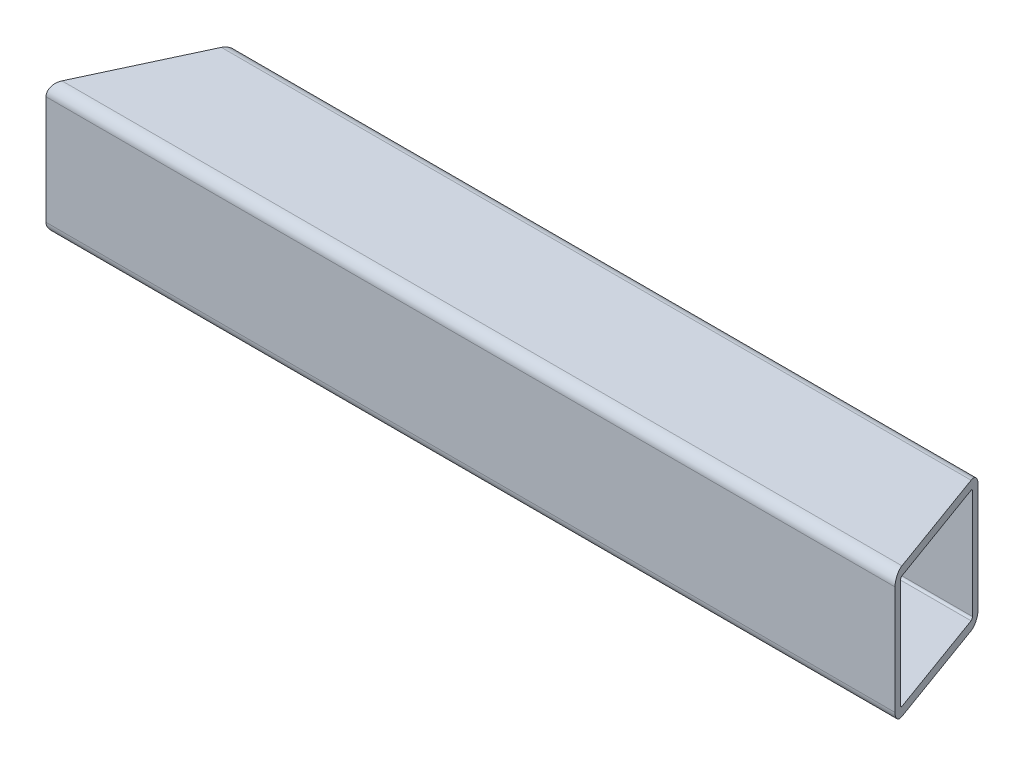
ISO-10303-21;
HEADER;
FILE_DESCRIPTION(('STEP AP214'),'2;1');
FILE_NAME('part.step','',(''),(''),'','','');
FILE_SCHEMA(('AUTOMOTIVE_DESIGN { 1 0 10303 214 1 1 1 1 }'));
ENDSEC;
DATA;
#1=APPLICATION_CONTEXT('core data for automotive mechanical design processes');
#2=APPLICATION_PROTOCOL_DEFINITION('international standard','automotive_design',2000,#1);
#3=PRODUCT_CONTEXT('',#1,'mechanical');
#4=PRODUCT('Part','Part','',(#3));
#5=PRODUCT_RELATED_PRODUCT_CATEGORY('part','',(#4));
#6=PRODUCT_DEFINITION_FORMATION('','',#4);
#7=PRODUCT_DEFINITION_CONTEXT('part definition',#1,'design');
#8=PRODUCT_DEFINITION('design','',#6,#7);
#9=PRODUCT_DEFINITION_SHAPE('','',#8);
#10=(LENGTH_UNIT() NAMED_UNIT(*) SI_UNIT(.MILLI.,.METRE.));
#11=(NAMED_UNIT(*) PLANE_ANGLE_UNIT() SI_UNIT($,.RADIAN.));
#12=(NAMED_UNIT(*) SI_UNIT($,.STERADIAN.) SOLID_ANGLE_UNIT());
#13=UNCERTAINTY_MEASURE_WITH_UNIT(LENGTH_MEASURE(1.E-05),#10,'distance_accuracy_value','');
#14=(GEOMETRIC_REPRESENTATION_CONTEXT(3) GLOBAL_UNCERTAINTY_ASSIGNED_CONTEXT((#13)) GLOBAL_UNIT_ASSIGNED_CONTEXT((#10,
#11,#12)) REPRESENTATION_CONTEXT('',''));
#15=CARTESIAN_POINT('',(0.,0.,0.));
#16=DIRECTION('',(0.,0.,1.));
#17=DIRECTION('',(1.,0.,0.));
#18=AXIS2_PLACEMENT_3D('',#15,#16,#17);
#19=CARTESIAN_POINT('',(123.98756,-15.875,15.875));
#20=DIRECTION('',(-1.,0.,0.));
#21=DIRECTION('',(0.,0.,1.));
#22=AXIS2_PLACEMENT_3D('',#19,#20,#21);
#23=CYLINDRICAL_SURFACE('',#22,3.175);
#24=CARTESIAN_POINT('',(-122.507033185358,-15.875,15.875));
#25=DIRECTION('',(-0.906307787036653,0.,-0.422618261740694));
#26=DIRECTION('',(-0.422618261740694,0.,0.906307787036653));
#27=AXIS2_PLACEMENT_3D('',#24,#25,#26);
#28=ELLIPSE('',#27,3.5032248927059,3.175);
#29=CARTESIAN_POINT('',(-122.507033185358,-19.05,15.875));
#30=VERTEX_POINT('',#29);
#31=CARTESIAN_POINT('',(-123.98756,-15.875,19.05));
#32=VERTEX_POINT('',#31);
#33=EDGE_CURVE('E199',#30,#32,#28,.T.);
#34=ORIENTED_EDGE('',*,*,#33,.F.);
#35=DIRECTION('',(-1.,0.,0.));
#36=VECTOR('',#35,1.);
#37=CARTESIAN_POINT('',(123.98756,-19.05,15.875));
#38=LINE('',#37,#36);
#39=CARTESIAN_POINT('',(122.831954506205,-19.05,15.875));
#40=VERTEX_POINT('',#39);
#41=EDGE_CURVE('E236',#40,#30,#38,.T.);
#42=ORIENTED_EDGE('',*,*,#41,.F.);
#43=CARTESIAN_POINT('',(122.831954506205,-15.875,15.875));
#44=DIRECTION('',(-0.939692620785911,0.,0.342020143325663));
#45=DIRECTION('',(-0.342020143325663,0.,-0.93969262078591));
#46=AXIS2_PLACEMENT_3D('',#43,#44,#45);
#47=ELLIPSE('',#46,3.37876442761102,3.175);
#48=CARTESIAN_POINT('',(123.98756,-15.875,19.05));
#49=VERTEX_POINT('',#48);
#50=EDGE_CURVE('E260',#40,#49,#47,.T.);
#51=ORIENTED_EDGE('',*,*,#50,.T.);
#52=DIRECTION('',(-1.,0.,0.));
#53=VECTOR('',#52,1.);
#54=CARTESIAN_POINT('',(123.98756,-15.875,19.05));
#55=LINE('',#54,#53);
#56=EDGE_CURVE('E219',#49,#32,#55,.T.);
#57=ORIENTED_EDGE('',*,*,#56,.T.);
#58=EDGE_LOOP('',(#34,#42,#51,#57));
#59=FACE_BOUND('',#58,.T.);
#60=ADVANCED_FACE('F81',(#59),#23,.T.);
#61=CARTESIAN_POINT('',(123.98756,-19.05,15.875));
#62=DIRECTION('',(0.,1.,0.));
#63=DIRECTION('',(0.,0.,1.));
#64=AXIS2_PLACEMENT_3D('',#61,#62,#63);
#65=PLANE('',#64);
#66=DIRECTION('',(-0.422618261740694,0.,0.906307787036653));
#67=VECTOR('',#66,1.);
#68=CARTESIAN_POINT('',(-78.4815717698162,-19.05,-78.5379066842573));
#69=LINE('',#68,#67);
#70=CARTESIAN_POINT('',(-107.701765038937,-19.05,-15.875));
#71=VERTEX_POINT('',#70);
#72=EDGE_CURVE('E305',#71,#30,#69,.T.);
#73=ORIENTED_EDGE('',*,*,#72,.F.);
#74=DIRECTION('',(-1.,0.,0.));
#75=VECTOR('',#74,1.);
#76=CARTESIAN_POINT('',(123.98756,-19.05,-15.875));
#77=LINE('',#76,#75);
#78=CARTESIAN_POINT('',(111.275899568253,-19.05,-15.875));
#79=VERTEX_POINT('',#78);
#80=EDGE_CURVE('E233',#79,#71,#77,.T.);
#81=ORIENTED_EDGE('',*,*,#80,.F.);
#82=DIRECTION('',(0.342020143325663,0.,0.93969262078591));
#83=VECTOR('',#82,1.);
#84=CARTESIAN_POINT('',(122.967134669623,-19.05,16.2464044465486));
#85=LINE('',#84,#83);
#86=EDGE_CURVE('E102',#79,#40,#85,.T.);
#87=ORIENTED_EDGE('',*,*,#86,.T.);
#88=ORIENTED_EDGE('',*,*,#41,.T.);
#89=EDGE_LOOP('',(#73,#81,#87,#88));
#90=FACE_BOUND('',#89,.T.);
#91=ADVANCED_FACE('F304',(#90),#65,.F.);
#92=CARTESIAN_POINT('',(123.98756,-15.875,-15.875));
#93=DIRECTION('',(-1.,0.,0.));
#94=DIRECTION('',(0.,0.,1.));
#95=AXIS2_PLACEMENT_3D('',#92,#93,#94);
#96=CYLINDRICAL_SURFACE('',#95,3.175);
#97=CARTESIAN_POINT('',(-107.701765038937,-15.875,-15.875));
#98=DIRECTION('',(-0.906307787036653,0.,-0.422618261740694));
#99=DIRECTION('',(-0.422618261740694,0.,0.906307787036653));
#100=AXIS2_PLACEMENT_3D('',#97,#98,#99);
#101=ELLIPSE('',#100,3.5032248927059,3.175);
#102=CARTESIAN_POINT('',(-106.221238224295,-15.875,-19.05));
#103=VERTEX_POINT('',#102);
#104=EDGE_CURVE('E306',#103,#71,#101,.T.);
#105=ORIENTED_EDGE('',*,*,#104,.F.);
#106=DIRECTION('',(-1.,0.,0.));
#107=VECTOR('',#106,1.);
#108=CARTESIAN_POINT('',(123.98756,-15.875,-19.05));
#109=LINE('',#108,#107);
#110=CARTESIAN_POINT('',(110.120294074458,-15.875,-19.05));
#111=VERTEX_POINT('',#110);
#112=EDGE_CURVE('E230',#111,#103,#109,.T.);
#113=ORIENTED_EDGE('',*,*,#112,.F.);
#114=CARTESIAN_POINT('',(111.275899568253,-15.875,-15.875));
#115=DIRECTION('',(-0.939692620785911,0.,0.342020143325663));
#116=DIRECTION('',(-0.342020143325663,0.,-0.93969262078591));
#117=AXIS2_PLACEMENT_3D('',#114,#115,#116);
#118=ELLIPSE('',#117,3.37876442761101,3.175);
#119=EDGE_CURVE('E296',#111,#79,#118,.T.);
#120=ORIENTED_EDGE('',*,*,#119,.T.);
#121=ORIENTED_EDGE('',*,*,#80,.T.);
#122=EDGE_LOOP('',(#105,#113,#120,#121));
#123=FACE_BOUND('',#122,.T.);
#124=ADVANCED_FACE('F301',(#123),#96,.T.);
#125=CARTESIAN_POINT('',(123.98756,15.875,-19.05));
#126=DIRECTION('',(0.,0.,1.));
#127=DIRECTION('',(0.,-1.,0.));
#128=AXIS2_PLACEMENT_3D('',#125,#126,#127);
#129=PLANE('',#128);
#130=DIRECTION('',(0.,-1.,0.));
#131=VECTOR('',#130,1.);
#132=CARTESIAN_POINT('',(-106.221238224295,379.908078836484,-19.05));
#133=LINE('',#132,#131);
#134=CARTESIAN_POINT('',(-106.221238224295,15.875,-19.05));
#135=VERTEX_POINT('',#134);
#136=EDGE_CURVE('E347',#135,#103,#133,.T.);
#137=ORIENTED_EDGE('',*,*,#136,.F.);
#138=DIRECTION('',(-1.,0.,0.));
#139=VECTOR('',#138,1.);
#140=CARTESIAN_POINT('',(123.98756,15.875,-19.05));
#141=LINE('',#140,#139);
#142=CARTESIAN_POINT('',(110.120294074458,15.875,-19.05));
#143=VERTEX_POINT('',#142);
#144=EDGE_CURVE('E227',#143,#135,#141,.T.);
#145=ORIENTED_EDGE('',*,*,#144,.F.);
#146=DIRECTION('',(0.,-1.,0.));
#147=VECTOR('',#146,1.);
#148=CARTESIAN_POINT('',(110.120294074458,383.876828836484,-19.05));
#149=LINE('',#148,#147);
#150=EDGE_CURVE('E308',#143,#111,#149,.T.);
#151=ORIENTED_EDGE('',*,*,#150,.T.);
#152=ORIENTED_EDGE('',*,*,#112,.T.);
#153=EDGE_LOOP('',(#137,#145,#151,#152));
#154=FACE_BOUND('',#153,.T.);
#155=ADVANCED_FACE('F352',(#154),#129,.F.);
#156=CARTESIAN_POINT('',(123.98756,15.875,-15.875));
#157=DIRECTION('',(-1.,0.,0.));
#158=DIRECTION('',(0.,0.,1.));
#159=AXIS2_PLACEMENT_3D('',#156,#157,#158);
#160=CYLINDRICAL_SURFACE('',#159,3.175);
#161=CARTESIAN_POINT('',(-107.701765038937,15.875,-15.875));
#162=DIRECTION('',(-0.906307787036653,0.,-0.422618261740694));
#163=DIRECTION('',(-0.422618261740694,0.,0.906307787036653));
#164=AXIS2_PLACEMENT_3D('',#161,#162,#163);
#165=ELLIPSE('',#164,3.50322489270591,3.175);
#166=CARTESIAN_POINT('',(-107.701765038937,19.05,-15.875));
#167=VERTEX_POINT('',#166);
#168=EDGE_CURVE('E310',#167,#135,#165,.T.);
#169=ORIENTED_EDGE('',*,*,#168,.F.);
#170=DIRECTION('',(-1.,0.,0.));
#171=VECTOR('',#170,1.);
#172=CARTESIAN_POINT('',(123.98756,19.05,-15.875));
#173=LINE('',#172,#171);
#174=CARTESIAN_POINT('',(111.275899568253,19.05,-15.875));
#175=VERTEX_POINT('',#174);
#176=EDGE_CURVE('E221',#175,#167,#173,.T.);
#177=ORIENTED_EDGE('',*,*,#176,.F.);
#178=CARTESIAN_POINT('',(111.275899568253,15.875,-15.875));
#179=DIRECTION('',(-0.939692620785911,0.,0.342020143325663));
#180=DIRECTION('',(-0.342020143325663,0.,-0.93969262078591));
#181=AXIS2_PLACEMENT_3D('',#178,#179,#180);
#182=ELLIPSE('',#181,3.37876442761102,3.175);
#183=EDGE_CURVE('E289',#175,#143,#182,.T.);
#184=ORIENTED_EDGE('',*,*,#183,.T.);
#185=ORIENTED_EDGE('',*,*,#144,.T.);
#186=EDGE_LOOP('',(#169,#177,#184,#185));
#187=FACE_BOUND('',#186,.T.);
#188=ADVANCED_FACE('F354',(#187),#160,.T.);
#189=CARTESIAN_POINT('',(123.98756,19.05,15.875));
#190=DIRECTION('',(0.,-1.,0.));
#191=DIRECTION('',(0.,0.,-1.));
#192=AXIS2_PLACEMENT_3D('',#189,#190,#191);
#193=PLANE('',#192);
#194=DIRECTION('',(0.422618261740694,0.,-0.906307787036653));
#195=VECTOR('',#194,1.);
#196=CARTESIAN_POINT('',(-78.4815717698162,19.05,-78.5379066842573));
#197=LINE('',#196,#195);
#198=CARTESIAN_POINT('',(-122.507033185358,19.05,15.875));
#199=VERTEX_POINT('',#198);
#200=EDGE_CURVE('E213',#199,#167,#197,.T.);
#201=ORIENTED_EDGE('',*,*,#200,.F.);
#202=DIRECTION('',(-1.,0.,0.));
#203=VECTOR('',#202,1.);
#204=CARTESIAN_POINT('',(123.98756,19.05,15.875));
#205=LINE('',#204,#203);
#206=CARTESIAN_POINT('',(122.831954506205,19.05,15.875));
#207=VERTEX_POINT('',#206);
#208=EDGE_CURVE('E212',#207,#199,#205,.T.);
#209=ORIENTED_EDGE('',*,*,#208,.F.);
#210=DIRECTION('',(-0.342020143325663,0.,-0.93969262078591));
#211=VECTOR('',#210,1.);
#212=CARTESIAN_POINT('',(122.967134669623,19.05,16.2464044465486));
#213=LINE('',#212,#211);
#214=EDGE_CURVE('E287',#207,#175,#213,.T.);
#215=ORIENTED_EDGE('',*,*,#214,.T.);
#216=ORIENTED_EDGE('',*,*,#176,.T.);
#217=EDGE_LOOP('',(#201,#209,#215,#216));
#218=FACE_BOUND('',#217,.T.);
#219=ADVANCED_FACE('F356',(#218),#193,.F.);
#220=CARTESIAN_POINT('',(123.98756,15.875,15.875));
#221=DIRECTION('',(-1.,0.,0.));
#222=DIRECTION('',(0.,0.,1.));
#223=AXIS2_PLACEMENT_3D('',#220,#221,#222);
#224=CYLINDRICAL_SURFACE('',#223,3.175);
#225=CARTESIAN_POINT('',(-122.507033185358,15.875,15.875));
#226=DIRECTION('',(-0.906307787036653,0.,-0.422618261740694));
#227=DIRECTION('',(-0.422618261740694,0.,0.906307787036653));
#228=AXIS2_PLACEMENT_3D('',#225,#226,#227);
#229=ELLIPSE('',#228,3.50322489270591,3.175);
#230=CARTESIAN_POINT('',(-123.98756,15.875,19.05));
#231=VERTEX_POINT('',#230);
#232=EDGE_CURVE('E196',#231,#199,#229,.T.);
#233=ORIENTED_EDGE('',*,*,#232,.F.);
#234=DIRECTION('',(-1.,0.,0.));
#235=VECTOR('',#234,1.);
#236=CARTESIAN_POINT('',(123.98756,15.875,19.05));
#237=LINE('',#236,#235);
#238=CARTESIAN_POINT('',(123.98756,15.875,19.05));
#239=VERTEX_POINT('',#238);
#240=EDGE_CURVE('E209',#239,#231,#237,.T.);
#241=ORIENTED_EDGE('',*,*,#240,.F.);
#242=CARTESIAN_POINT('',(122.831954506205,15.875,15.875));
#243=DIRECTION('',(-0.939692620785911,0.,0.342020143325663));
#244=DIRECTION('',(-0.342020143325663,0.,-0.93969262078591));
#245=AXIS2_PLACEMENT_3D('',#242,#243,#244);
#246=ELLIPSE('',#245,3.37876442761102,3.175);
#247=EDGE_CURVE('E285',#239,#207,#246,.T.);
#248=ORIENTED_EDGE('',*,*,#247,.T.);
#249=ORIENTED_EDGE('',*,*,#208,.T.);
#250=EDGE_LOOP('',(#233,#241,#248,#249));
#251=FACE_BOUND('',#250,.T.);
#252=ADVANCED_FACE('F208',(#251),#224,.T.);
#253=CARTESIAN_POINT('',(123.98756,-15.875,15.875));
#254=DIRECTION('',(-1.,0.,0.));
#255=DIRECTION('',(0.,0.,1.));
#256=AXIS2_PLACEMENT_3D('',#253,#254,#255);
#257=CYLINDRICAL_SURFACE('',#256,0.635000000000002);
#258=DIRECTION('',(-1.,0.,0.));
#259=VECTOR('',#258,1.);
#260=CARTESIAN_POINT('',(123.98756,-16.51,15.875));
#261=LINE('',#260,#259);
#262=CARTESIAN_POINT('',(122.831954506205,-16.51,15.875));
#263=VERTEX_POINT('',#262);
#264=CARTESIAN_POINT('',(-122.507033185358,-16.51,15.875));
#265=VERTEX_POINT('',#264);
#266=EDGE_CURVE('E204',#263,#265,#261,.T.);
#267=ORIENTED_EDGE('',*,*,#266,.T.);
#268=CARTESIAN_POINT('',(-122.507033185358,-15.875,15.875));
#269=DIRECTION('',(-0.906307787036653,0.,-0.422618261740694));
#270=DIRECTION('',(-0.422618261740694,0.,0.906307787036653));
#271=AXIS2_PLACEMENT_3D('',#268,#269,#270);
#272=ELLIPSE('',#271,0.700644978541183,0.635000000000002);
#273=CARTESIAN_POINT('',(-122.803138548286,-15.875,16.51));
#274=VERTEX_POINT('',#273);
#275=EDGE_CURVE('E214',#265,#274,#272,.T.);
#276=ORIENTED_EDGE('',*,*,#275,.T.);
#277=DIRECTION('',(-1.,0.,0.));
#278=VECTOR('',#277,1.);
#279=CARTESIAN_POINT('',(123.98756,-15.875,16.51));
#280=LINE('',#279,#278);
#281=CARTESIAN_POINT('',(123.063075604964,-15.875,16.51));
#282=VERTEX_POINT('',#281);
#283=EDGE_CURVE('E252',#282,#274,#280,.T.);
#284=ORIENTED_EDGE('',*,*,#283,.F.);
#285=CARTESIAN_POINT('',(122.831954506205,-15.875,15.875));
#286=DIRECTION('',(-0.939692620785911,0.,0.342020143325663));
#287=DIRECTION('',(-0.342020143325663,0.,-0.93969262078591));
#288=AXIS2_PLACEMENT_3D('',#285,#286,#287);
#289=ELLIPSE('',#288,0.675752885522205,0.635000000000002);
#290=EDGE_CURVE('E247',#263,#282,#289,.T.);
#291=ORIENTED_EDGE('',*,*,#290,.F.);
#292=EDGE_LOOP('',(#267,#276,#284,#291));
#293=FACE_BOUND('',#292,.T.);
#294=ADVANCED_FACE('F258',(#293),#257,.F.);
#295=CARTESIAN_POINT('',(123.98756,-16.51,15.875));
#296=DIRECTION('',(0.,1.,0.));
#297=DIRECTION('',(0.,0.,1.));
#298=AXIS2_PLACEMENT_3D('',#295,#296,#297);
#299=PLANE('',#298);
#300=DIRECTION('',(-1.,0.,0.));
#301=VECTOR('',#300,1.);
#302=CARTESIAN_POINT('',(123.98756,-16.51,-15.875));
#303=LINE('',#302,#301);
#304=CARTESIAN_POINT('',(111.275899568253,-16.51,-15.875));
#305=VERTEX_POINT('',#304);
#306=CARTESIAN_POINT('',(-107.701765038937,-16.51,-15.875));
#307=VERTEX_POINT('',#306);
#308=EDGE_CURVE('E279',#305,#307,#303,.T.);
#309=ORIENTED_EDGE('',*,*,#308,.T.);
#310=DIRECTION('',(-0.422618261740694,0.,0.906307787036653));
#311=VECTOR('',#310,1.);
#312=CARTESIAN_POINT('',(-78.4815717698162,-16.51,-78.5379066842573));
#313=LINE('',#312,#311);
#314=EDGE_CURVE('E336',#307,#265,#313,.T.);
#315=ORIENTED_EDGE('',*,*,#314,.T.);
#316=ORIENTED_EDGE('',*,*,#266,.F.);
#317=DIRECTION('',(0.342020143325663,0.,0.93969262078591));
#318=VECTOR('',#317,1.);
#319=CARTESIAN_POINT('',(122.967134669623,-16.51,16.2464044465486));
#320=LINE('',#319,#318);
#321=EDGE_CURVE('E291',#305,#263,#320,.T.);
#322=ORIENTED_EDGE('',*,*,#321,.F.);
#323=EDGE_LOOP('',(#309,#315,#316,#322));
#324=FACE_BOUND('',#323,.T.);
#325=ADVANCED_FACE('F328',(#324),#299,.T.);
#326=CARTESIAN_POINT('',(123.98756,-15.875,-15.875));
#327=DIRECTION('',(-1.,0.,0.));
#328=DIRECTION('',(0.,0.,1.));
#329=AXIS2_PLACEMENT_3D('',#326,#327,#328);
#330=CYLINDRICAL_SURFACE('',#329,0.634999999999999);
#331=DIRECTION('',(-1.,0.,0.));
#332=VECTOR('',#331,1.);
#333=CARTESIAN_POINT('',(123.98756,-15.875,-16.51));
#334=LINE('',#333,#332);
#335=CARTESIAN_POINT('',(111.044778469494,-15.875,-16.51));
#336=VERTEX_POINT('',#335);
#337=CARTESIAN_POINT('',(-107.405659676009,-15.875,-16.51));
#338=VERTEX_POINT('',#337);
#339=EDGE_CURVE('E276',#336,#338,#334,.T.);
#340=ORIENTED_EDGE('',*,*,#339,.T.);
#341=CARTESIAN_POINT('',(-107.701765038937,-15.875,-15.875));
#342=DIRECTION('',(-0.906307787036653,0.,-0.422618261740694));
#343=DIRECTION('',(-0.422618261740694,0.,0.906307787036653));
#344=AXIS2_PLACEMENT_3D('',#341,#342,#343);
#345=ELLIPSE('',#344,0.700644978541179,0.634999999999999);
#346=EDGE_CURVE('E334',#338,#307,#345,.T.);
#347=ORIENTED_EDGE('',*,*,#346,.T.);
#348=ORIENTED_EDGE('',*,*,#308,.F.);
#349=CARTESIAN_POINT('',(111.275899568253,-15.875,-15.875));
#350=DIRECTION('',(-0.939692620785911,0.,0.342020143325663));
#351=DIRECTION('',(-0.342020143325663,0.,-0.93969262078591));
#352=AXIS2_PLACEMENT_3D('',#349,#350,#351);
#353=ELLIPSE('',#352,0.675752885522201,0.634999999999999);
#354=EDGE_CURVE('E324',#336,#305,#353,.T.);
#355=ORIENTED_EDGE('',*,*,#354,.F.);
#356=EDGE_LOOP('',(#340,#347,#348,#355));
#357=FACE_BOUND('',#356,.T.);
#358=ADVANCED_FACE('F332',(#357),#330,.F.);
#359=CARTESIAN_POINT('',(123.98756,15.875,-16.51));
#360=DIRECTION('',(0.,0.,1.));
#361=DIRECTION('',(0.,-1.,0.));
#362=AXIS2_PLACEMENT_3D('',#359,#360,#361);
#363=PLANE('',#362);
#364=DIRECTION('',(-1.,0.,0.));
#365=VECTOR('',#364,1.);
#366=CARTESIAN_POINT('',(123.98756,15.875,-16.51));
#367=LINE('',#366,#365);
#368=CARTESIAN_POINT('',(111.044778469494,15.875,-16.51));
#369=VERTEX_POINT('',#368);
#370=CARTESIAN_POINT('',(-107.405659676009,15.875,-16.51));
#371=VERTEX_POINT('',#370);
#372=EDGE_CURVE('E273',#369,#371,#367,.T.);
#373=ORIENTED_EDGE('',*,*,#372,.T.);
#374=DIRECTION('',(0.,-1.,0.));
#375=VECTOR('',#374,1.);
#376=CARTESIAN_POINT('',(-107.405659676009,15.875,-16.51));
#377=LINE('',#376,#375);
#378=EDGE_CURVE('E337',#371,#338,#377,.T.);
#379=ORIENTED_EDGE('',*,*,#378,.T.);
#380=ORIENTED_EDGE('',*,*,#339,.F.);
#381=DIRECTION('',(0.,-1.,0.));
#382=VECTOR('',#381,1.);
#383=CARTESIAN_POINT('',(111.044778469494,15.875,-16.51));
#384=LINE('',#383,#382);
#385=EDGE_CURVE('E321',#369,#336,#384,.T.);
#386=ORIENTED_EDGE('',*,*,#385,.F.);
#387=EDGE_LOOP('',(#373,#379,#380,#386));
#388=FACE_BOUND('',#387,.T.);
#389=ADVANCED_FACE('F419',(#388),#363,.T.);
#390=CARTESIAN_POINT('',(123.98756,15.875,-15.875));
#391=DIRECTION('',(-1.,0.,0.));
#392=DIRECTION('',(0.,0.,1.));
#393=AXIS2_PLACEMENT_3D('',#390,#391,#392);
#394=CYLINDRICAL_SURFACE('',#393,0.635000000000004);
#395=DIRECTION('',(-1.,0.,0.));
#396=VECTOR('',#395,1.);
#397=CARTESIAN_POINT('',(123.98756,16.51,-15.875));
#398=LINE('',#397,#396);
#399=CARTESIAN_POINT('',(111.275899568253,16.51,-15.875));
#400=VERTEX_POINT('',#399);
#401=CARTESIAN_POINT('',(-107.701765038937,16.51,-15.875));
#402=VERTEX_POINT('',#401);
#403=EDGE_CURVE('E270',#400,#402,#398,.T.);
#404=ORIENTED_EDGE('',*,*,#403,.T.);
#405=CARTESIAN_POINT('',(-107.701765038937,15.875,-15.875));
#406=DIRECTION('',(-0.906307787036653,0.,-0.422618261740694));
#407=DIRECTION('',(-0.422618261740694,0.,0.906307787036653));
#408=AXIS2_PLACEMENT_3D('',#405,#406,#407);
#409=ELLIPSE('',#408,0.700644978541185,0.635000000000004);
#410=EDGE_CURVE('E340',#402,#371,#409,.T.);
#411=ORIENTED_EDGE('',*,*,#410,.T.);
#412=ORIENTED_EDGE('',*,*,#372,.F.);
#413=CARTESIAN_POINT('',(111.275899568253,15.875,-15.875));
#414=DIRECTION('',(-0.939692620785911,0.,0.342020143325663));
#415=DIRECTION('',(-0.342020143325663,0.,-0.93969262078591));
#416=AXIS2_PLACEMENT_3D('',#413,#414,#415);
#417=ELLIPSE('',#416,0.675752885522207,0.635000000000004);
#418=EDGE_CURVE('E318',#400,#369,#417,.T.);
#419=ORIENTED_EDGE('',*,*,#418,.F.);
#420=EDGE_LOOP('',(#404,#411,#412,#419));
#421=FACE_BOUND('',#420,.T.);
#422=ADVANCED_FACE('F428',(#421),#394,.F.);
#423=CARTESIAN_POINT('',(123.98756,16.51,15.875));
#424=DIRECTION('',(0.,-1.,0.));
#425=DIRECTION('',(0.,0.,-1.));
#426=AXIS2_PLACEMENT_3D('',#423,#424,#425);
#427=PLANE('',#426);
#428=DIRECTION('',(-1.,0.,0.));
#429=VECTOR('',#428,1.);
#430=CARTESIAN_POINT('',(123.98756,16.51,15.875));
#431=LINE('',#430,#429);
#432=CARTESIAN_POINT('',(122.831954506205,16.51,15.875));
#433=VERTEX_POINT('',#432);
#434=CARTESIAN_POINT('',(-122.507033185358,16.51,15.875));
#435=VERTEX_POINT('',#434);
#436=EDGE_CURVE('E262',#433,#435,#431,.T.);
#437=ORIENTED_EDGE('',*,*,#436,.T.);
#438=DIRECTION('',(0.422618261740694,0.,-0.906307787036653));
#439=VECTOR('',#438,1.);
#440=CARTESIAN_POINT('',(-78.4815717698162,16.51,-78.5379066842573));
#441=LINE('',#440,#439);
#442=EDGE_CURVE('E511',#435,#402,#441,.T.);
#443=ORIENTED_EDGE('',*,*,#442,.T.);
#444=ORIENTED_EDGE('',*,*,#403,.F.);
#445=DIRECTION('',(-0.342020143325663,0.,-0.93969262078591));
#446=VECTOR('',#445,1.);
#447=CARTESIAN_POINT('',(122.967134669623,16.51,16.2464044465486));
#448=LINE('',#447,#446);
#449=EDGE_CURVE('E316',#433,#400,#448,.T.);
#450=ORIENTED_EDGE('',*,*,#449,.F.);
#451=EDGE_LOOP('',(#437,#443,#444,#450));
#452=FACE_BOUND('',#451,.T.);
#453=ADVANCED_FACE('F438',(#452),#427,.T.);
#454=CARTESIAN_POINT('',(123.98756,15.875,15.875));
#455=DIRECTION('',(-1.,0.,0.));
#456=DIRECTION('',(0.,0.,1.));
#457=AXIS2_PLACEMENT_3D('',#454,#455,#456);
#458=CYLINDRICAL_SURFACE('',#457,0.635000000000004);
#459=DIRECTION('',(-1.,0.,0.));
#460=VECTOR('',#459,1.);
#461=CARTESIAN_POINT('',(123.98756,15.875,16.51));
#462=LINE('',#461,#460);
#463=CARTESIAN_POINT('',(123.063075604964,15.875,16.51));
#464=VERTEX_POINT('',#463);
#465=CARTESIAN_POINT('',(-122.803138548286,15.875,16.51));
#466=VERTEX_POINT('',#465);
#467=EDGE_CURVE('E254',#464,#466,#462,.T.);
#468=ORIENTED_EDGE('',*,*,#467,.T.);
#469=CARTESIAN_POINT('',(-122.507033185358,15.875,15.875));
#470=DIRECTION('',(-0.906307787036653,0.,-0.422618261740694));
#471=DIRECTION('',(-0.422618261740694,0.,0.906307787036653));
#472=AXIS2_PLACEMENT_3D('',#469,#470,#471);
#473=ELLIPSE('',#472,0.700644978541185,0.635000000000004);
#474=EDGE_CURVE('E95',#466,#435,#473,.T.);
#475=ORIENTED_EDGE('',*,*,#474,.T.);
#476=ORIENTED_EDGE('',*,*,#436,.F.);
#477=CARTESIAN_POINT('',(122.831954506205,15.875,15.875));
#478=DIRECTION('',(-0.939692620785911,0.,0.342020143325663));
#479=DIRECTION('',(-0.342020143325663,0.,-0.93969262078591));
#480=AXIS2_PLACEMENT_3D('',#477,#478,#479);
#481=ELLIPSE('',#480,0.675752885522207,0.635000000000004);
#482=EDGE_CURVE('E246',#464,#433,#481,.T.);
#483=ORIENTED_EDGE('',*,*,#482,.F.);
#484=EDGE_LOOP('',(#468,#475,#476,#483));
#485=FACE_BOUND('',#484,.T.);
#486=ADVANCED_FACE('F448',(#485),#458,.F.);
#487=CARTESIAN_POINT('',(123.98756,15.875,16.51));
#488=DIRECTION('',(0.,0.,-1.));
#489=DIRECTION('',(0.,1.,0.));
#490=AXIS2_PLACEMENT_3D('',#487,#488,#489);
#491=PLANE('',#490);
#492=ORIENTED_EDGE('',*,*,#283,.T.);
#493=DIRECTION('',(0.,1.,0.));
#494=VECTOR('',#493,1.);
#495=CARTESIAN_POINT('',(-122.803138548286,15.875,16.51));
#496=LINE('',#495,#494);
#497=EDGE_CURVE('E12',#274,#466,#496,.T.);
#498=ORIENTED_EDGE('',*,*,#497,.T.);
#499=ORIENTED_EDGE('',*,*,#467,.F.);
#500=DIRECTION('',(0.,1.,0.));
#501=VECTOR('',#500,1.);
#502=CARTESIAN_POINT('',(123.063075604964,15.875,16.51));
#503=LINE('',#502,#501);
#504=EDGE_CURVE('E88',#282,#464,#503,.T.);
#505=ORIENTED_EDGE('',*,*,#504,.F.);
#506=EDGE_LOOP('',(#492,#498,#499,#505));
#507=FACE_BOUND('',#506,.T.);
#508=ADVANCED_FACE('F251',(#507),#491,.T.);
#509=CARTESIAN_POINT('',(123.98756,15.875,19.05));
#510=DIRECTION('',(0.,0.,-1.));
#511=DIRECTION('',(0.,1.,0.));
#512=AXIS2_PLACEMENT_3D('',#509,#510,#511);
#513=PLANE('',#512);
#514=DIRECTION('',(0.,-1.,0.));
#515=VECTOR('',#514,1.);
#516=CARTESIAN_POINT('',(-123.98756,15.875,19.05));
#517=LINE('',#516,#515);
#518=EDGE_CURVE('E193',#231,#32,#517,.T.);
#519=ORIENTED_EDGE('',*,*,#518,.T.);
#520=ORIENTED_EDGE('',*,*,#56,.F.);
#521=DIRECTION('',(0.,-1.,0.));
#522=VECTOR('',#521,1.);
#523=CARTESIAN_POINT('',(123.98756,15.875,19.05));
#524=LINE('',#523,#522);
#525=EDGE_CURVE('E203',#239,#49,#524,.T.);
#526=ORIENTED_EDGE('',*,*,#525,.F.);
#527=ORIENTED_EDGE('',*,*,#240,.T.);
#528=EDGE_LOOP('',(#519,#520,#526,#527));
#529=FACE_BOUND('',#528,.T.);
#530=ADVANCED_FACE('F216',(#529),#513,.F.);
#531=CARTESIAN_POINT('',(123.98756,383.876828836484,19.05));
#532=DIRECTION('',(-0.939692620785911,0.,0.342020143325663));
#533=DIRECTION('',(0.342020143325663,0.,0.93969262078591));
#534=AXIS2_PLACEMENT_3D('',#531,#532,#533);
#535=PLANE('',#534);
#536=ORIENTED_EDGE('',*,*,#321,.T.);
#537=ORIENTED_EDGE('',*,*,#290,.T.);
#538=ORIENTED_EDGE('',*,*,#504,.T.);
#539=ORIENTED_EDGE('',*,*,#482,.T.);
#540=ORIENTED_EDGE('',*,*,#449,.T.);
#541=ORIENTED_EDGE('',*,*,#418,.T.);
#542=ORIENTED_EDGE('',*,*,#385,.T.);
#543=ORIENTED_EDGE('',*,*,#354,.T.);
#544=EDGE_LOOP('',(#536,#537,#538,#539,#540,#541,#542,#543));
#545=FACE_BOUND('',#544,.T.);
#546=ORIENTED_EDGE('',*,*,#50,.F.);
#547=ORIENTED_EDGE('',*,*,#86,.F.);
#548=ORIENTED_EDGE('',*,*,#119,.F.);
#549=ORIENTED_EDGE('',*,*,#150,.F.);
#550=ORIENTED_EDGE('',*,*,#183,.F.);
#551=ORIENTED_EDGE('',*,*,#214,.F.);
#552=ORIENTED_EDGE('',*,*,#247,.F.);
#553=ORIENTED_EDGE('',*,*,#525,.T.);
#554=EDGE_LOOP('',(#546,#547,#548,#549,#550,#551,#552,#553));
#555=FACE_BOUND('',#554,.T.);
#556=ADVANCED_FACE('F242',(#545,#555),#535,.F.);
#557=CARTESIAN_POINT('',(-123.98756,379.908078836484,19.05));
#558=DIRECTION('',(-0.906307787036653,0.,-0.422618261740694));
#559=DIRECTION('',(-0.422618261740694,0.,0.906307787036653));
#560=AXIS2_PLACEMENT_3D('',#557,#558,#559);
#561=PLANE('',#560);
#562=ORIENTED_EDGE('',*,*,#275,.F.);
#563=ORIENTED_EDGE('',*,*,#314,.F.);
#564=ORIENTED_EDGE('',*,*,#346,.F.);
#565=ORIENTED_EDGE('',*,*,#378,.F.);
#566=ORIENTED_EDGE('',*,*,#410,.F.);
#567=ORIENTED_EDGE('',*,*,#442,.F.);
#568=ORIENTED_EDGE('',*,*,#474,.F.);
#569=ORIENTED_EDGE('',*,*,#497,.F.);
#570=EDGE_LOOP('',(#562,#563,#564,#565,#566,#567,#568,#569));
#571=FACE_BOUND('',#570,.T.);
#572=ORIENTED_EDGE('',*,*,#72,.T.);
#573=ORIENTED_EDGE('',*,*,#33,.T.);
#574=ORIENTED_EDGE('',*,*,#518,.F.);
#575=ORIENTED_EDGE('',*,*,#232,.T.);
#576=ORIENTED_EDGE('',*,*,#200,.T.);
#577=ORIENTED_EDGE('',*,*,#168,.T.);
#578=ORIENTED_EDGE('',*,*,#136,.T.);
#579=ORIENTED_EDGE('',*,*,#104,.T.);
#580=EDGE_LOOP('',(#572,#573,#574,#575,#576,#577,#578,#579));
#581=FACE_BOUND('',#580,.T.);
#582=ADVANCED_FACE('F195',(#571,#581),#561,.T.);
#583=CLOSED_SHELL('',(#60,#91,#124,#155,#188,#219,#252,#294,#325,#358,#389,#422,#453,#486,#508,
#530,#556,#582));
#584=MANIFOLD_SOLID_BREP('B2',#583);
#585=ADVANCED_BREP_SHAPE_REPRESENTATION('',(#18,#584),#14);
#586=SHAPE_DEFINITION_REPRESENTATION(#9,#585);
ENDSEC;
END-ISO-10303-21;
